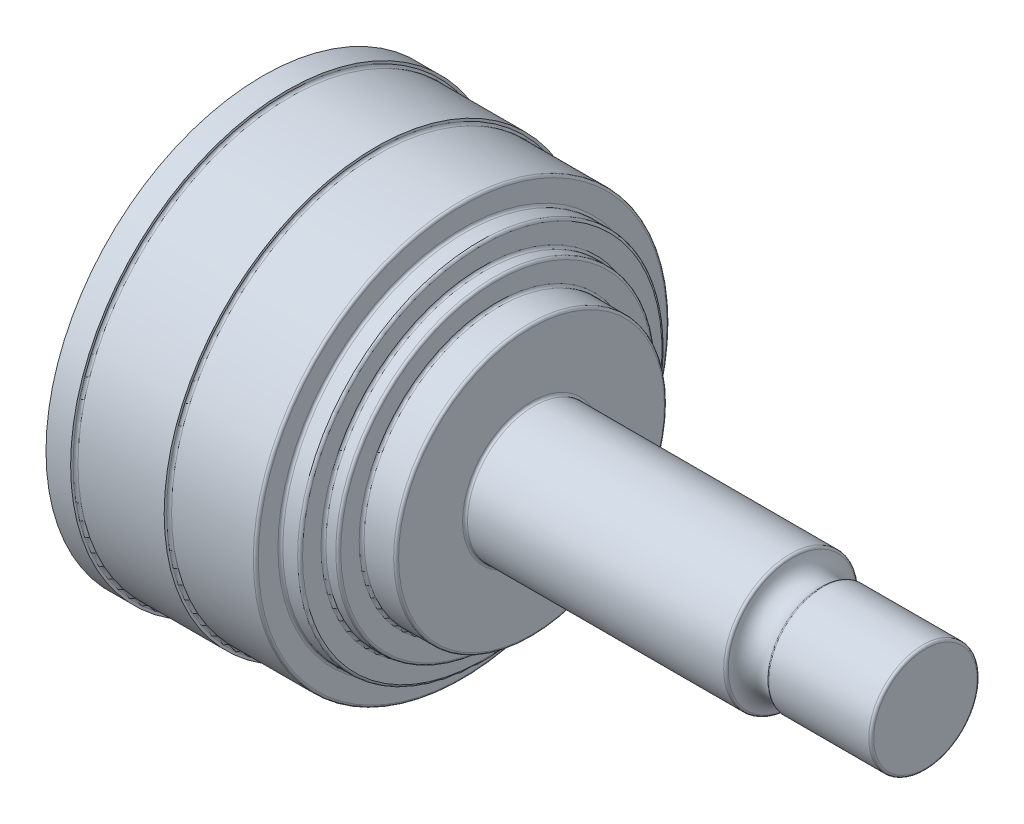
ISO-10303-21;
HEADER;
FILE_DESCRIPTION(('STEP AP214'),'2;1');
FILE_NAME('part.step','',(''),(''),'','','');
FILE_SCHEMA(('AUTOMOTIVE_DESIGN { 1 0 10303 214 1 1 1 1 }'));
ENDSEC;
DATA;
#1=APPLICATION_CONTEXT('core data for automotive mechanical design processes');
#2=APPLICATION_PROTOCOL_DEFINITION('international standard','automotive_design',2000,#1);
#3=PRODUCT_CONTEXT('',#1,'mechanical');
#4=PRODUCT('Part','Part','',(#3));
#5=PRODUCT_RELATED_PRODUCT_CATEGORY('part','',(#4));
#6=PRODUCT_DEFINITION_FORMATION('','',#4);
#7=PRODUCT_DEFINITION_CONTEXT('part definition',#1,'design');
#8=PRODUCT_DEFINITION('design','',#6,#7);
#9=PRODUCT_DEFINITION_SHAPE('','',#8);
#10=(LENGTH_UNIT() NAMED_UNIT(*) SI_UNIT(.MILLI.,.METRE.));
#11=(NAMED_UNIT(*) PLANE_ANGLE_UNIT() SI_UNIT($,.RADIAN.));
#12=(NAMED_UNIT(*) SI_UNIT($,.STERADIAN.) SOLID_ANGLE_UNIT());
#13=UNCERTAINTY_MEASURE_WITH_UNIT(LENGTH_MEASURE(1.E-05),#10,'distance_accuracy_value','');
#14=(GEOMETRIC_REPRESENTATION_CONTEXT(3) GLOBAL_UNCERTAINTY_ASSIGNED_CONTEXT((#13)) GLOBAL_UNIT_ASSIGNED_CONTEXT((#10,
#11,#12)) REPRESENTATION_CONTEXT('',''));
#15=CARTESIAN_POINT('',(0.,0.,0.));
#16=DIRECTION('',(0.,0.,1.));
#17=DIRECTION('',(1.,0.,0.));
#18=AXIS2_PLACEMENT_3D('',#15,#16,#17);
#19=CARTESIAN_POINT('',(134.6,0.,0.));
#20=DIRECTION('',(-1.,0.,0.));
#21=DIRECTION('',(0.,0.,1.));
#22=AXIS2_PLACEMENT_3D('',#19,#20,#21);
#23=PLANE('',#22);
#24=CARTESIAN_POINT('',(134.6,0.,0.));
#25=DIRECTION('',(-1.,0.,0.));
#26=DIRECTION('',(0.,0.,1.));
#27=AXIS2_PLACEMENT_3D('',#24,#25,#26);
#28=CIRCLE('',#27,10.5);
#29=CARTESIAN_POINT('',(134.6,0.,10.5));
#30=VERTEX_POINT('',#29);
#31=EDGE_CURVE('E112',#30,#30,#28,.F.);
#32=ORIENTED_EDGE('',*,*,#31,.T.);
#33=EDGE_LOOP('',(#32));
#34=FACE_BOUND('',#33,.T.);
#35=ADVANCED_FACE('F35',(#34),#23,.F.);
#36=CARTESIAN_POINT('',(-159.727345131747,0.,0.));
#37=DIRECTION('',(-1.,0.,0.));
#38=DIRECTION('',(0.,0.,1.));
#39=AXIS2_PLACEMENT_3D('',#36,#37,#38);
#40=CYLINDRICAL_SURFACE('',#39,11.);
#41=CARTESIAN_POINT('',(134.1,0.,0.));
#42=DIRECTION('',(-1.,0.,0.));
#43=DIRECTION('',(0.,0.,1.));
#44=AXIS2_PLACEMENT_3D('',#41,#42,#43);
#45=CIRCLE('',#44,11.);
#46=CARTESIAN_POINT('',(134.1,0.,11.));
#47=VERTEX_POINT('',#46);
#48=EDGE_CURVE('E115',#47,#47,#45,.T.);
#49=ORIENTED_EDGE('',*,*,#48,.T.);
#50=EDGE_LOOP('',(#49));
#51=FACE_BOUND('',#50,.T.);
#52=CARTESIAN_POINT('',(113.797977463642,0.,0.));
#53=DIRECTION('',(1.,0.,0.));
#54=DIRECTION('',(0.,0.,-1.));
#55=AXIS2_PLACEMENT_3D('',#52,#53,#54);
#56=CIRCLE('',#55,11.);
#57=CARTESIAN_POINT('',(113.797977463642,0.,-11.));
#58=VERTEX_POINT('',#57);
#59=EDGE_CURVE('E118',#58,#58,#56,.T.);
#60=ORIENTED_EDGE('',*,*,#59,.T.);
#61=EDGE_LOOP('',(#60));
#62=FACE_BOUND('',#61,.T.);
#63=ADVANCED_FACE('F149',(#51,#62),#40,.T.);
#64=CARTESIAN_POINT('',(111.120833333333,0.,0.));
#65=DIRECTION('',(-1.,0.,0.));
#66=DIRECTION('',(0.,0.,1.));
#67=AXIS2_PLACEMENT_3D('',#64,#65,#66);
#68=TOROIDAL_SURFACE('',#67,13.5,3.52083333333331);
#69=CARTESIAN_POINT('',(113.465068348992,0.,0.));
#70=DIRECTION('',(-1.,0.,0.));
#71=DIRECTION('',(0.,0.,1.));
#72=AXIS2_PLACEMENT_3D('',#69,#70,#71);
#73=CIRCLE('',#72,10.8730569948187);
#74=CARTESIAN_POINT('',(113.465068348992,0.,10.8730569948187));
#75=VERTEX_POINT('',#74);
#76=EDGE_CURVE('E106',#75,#75,#73,.T.);
#77=ORIENTED_EDGE('',*,*,#76,.T.);
#78=EDGE_LOOP('',(#77));
#79=FACE_BOUND('',#78,.T.);
#80=CARTESIAN_POINT('',(107.627328266597,0.,0.));
#81=DIRECTION('',(1.,0.,0.));
#82=DIRECTION('',(0.,0.,-1.));
#83=AXIS2_PLACEMENT_3D('',#80,#81,#82);
#84=CIRCLE('',#83,13.0621761658032);
#85=CARTESIAN_POINT('',(107.627328266597,0.,-13.0621761658032));
#86=VERTEX_POINT('',#85);
#87=EDGE_CURVE('E109',#86,#86,#84,.T.);
#88=ORIENTED_EDGE('',*,*,#87,.T.);
#89=EDGE_LOOP('',(#88));
#90=FACE_BOUND('',#89,.T.);
#91=ADVANCED_FACE('F155',(#79,#90),#68,.F.);
#92=CARTESIAN_POINT('',(-159.727345131747,0.,0.));
#93=DIRECTION('',(-1.,0.,0.));
#94=DIRECTION('',(0.,0.,1.));
#95=AXIS2_PLACEMENT_3D('',#92,#93,#94);
#96=CYLINDRICAL_SURFACE('',#95,13.5);
#97=CARTESIAN_POINT('',(107.131209203864,0.,0.));
#98=DIRECTION('',(1.,0.,0.));
#99=DIRECTION('',(0.,0.,-1.));
#100=AXIS2_PLACEMENT_3D('',#97,#98,#99);
#101=CIRCLE('',#100,13.5);
#102=CARTESIAN_POINT('',(107.131209203864,0.,-13.5));
#103=VERTEX_POINT('',#102);
#104=EDGE_CURVE('E100',#103,#103,#101,.F.);
#105=ORIENTED_EDGE('',*,*,#104,.T.);
#106=EDGE_LOOP('',(#105));
#107=FACE_BOUND('',#106,.T.);
#108=CARTESIAN_POINT('',(55.1,0.,0.));
#109=DIRECTION('',(-1.,0.,0.));
#110=DIRECTION('',(0.,0.,1.));
#111=AXIS2_PLACEMENT_3D('',#108,#109,#110);
#112=CIRCLE('',#111,13.5);
#113=CARTESIAN_POINT('',(55.1,0.,13.5));
#114=VERTEX_POINT('',#113);
#115=EDGE_CURVE('E103',#114,#114,#112,.F.);
#116=ORIENTED_EDGE('',*,*,#115,.T.);
#117=EDGE_LOOP('',(#116));
#118=FACE_BOUND('',#117,.T.);
#119=ADVANCED_FACE('F253',(#107,#118),#96,.T.);
#120=CARTESIAN_POINT('',(54.6,13.5,0.));
#121=DIRECTION('',(-1.,0.,0.));
#122=DIRECTION('',(0.,0.,1.));
#123=AXIS2_PLACEMENT_3D('',#120,#121,#122);
#124=PLANE('',#123);
#125=CARTESIAN_POINT('',(54.6,0.,0.));
#126=DIRECTION('',(-1.,0.,0.));
#127=DIRECTION('',(0.,0.,1.));
#128=AXIS2_PLACEMENT_3D('',#125,#126,#127);
#129=CIRCLE('',#128,14.);
#130=CARTESIAN_POINT('',(54.6,0.,14.));
#131=VERTEX_POINT('',#130);
#132=EDGE_CURVE('E94',#131,#131,#129,.T.);
#133=ORIENTED_EDGE('',*,*,#132,.T.);
#134=EDGE_LOOP('',(#133));
#135=FACE_BOUND('',#134,.T.);
#136=CARTESIAN_POINT('',(54.6,0.,0.));
#137=DIRECTION('',(-1.,0.,0.));
#138=DIRECTION('',(0.,0.,1.));
#139=AXIS2_PLACEMENT_3D('',#136,#137,#138);
#140=CIRCLE('',#139,27.);
#141=CARTESIAN_POINT('',(54.6,0.,27.));
#142=VERTEX_POINT('',#141);
#143=EDGE_CURVE('E97',#142,#142,#140,.F.);
#144=ORIENTED_EDGE('',*,*,#143,.T.);
#145=EDGE_LOOP('',(#144));
#146=FACE_BOUND('',#145,.T.);
#147=ADVANCED_FACE('F249',(#135,#146),#124,.F.);
#148=CARTESIAN_POINT('',(-159.727345131747,0.,0.));
#149=DIRECTION('',(-1.,0.,0.));
#150=DIRECTION('',(0.,0.,1.));
#151=AXIS2_PLACEMENT_3D('',#148,#149,#150);
#152=CYLINDRICAL_SURFACE('',#151,27.5);
#153=CARTESIAN_POINT('',(54.1,0.,0.));
#154=DIRECTION('',(-1.,0.,0.));
#155=DIRECTION('',(0.,0.,1.));
#156=AXIS2_PLACEMENT_3D('',#153,#154,#155);
#157=CIRCLE('',#156,27.5);
#158=CARTESIAN_POINT('',(54.1,0.,27.5));
#159=VERTEX_POINT('',#158);
#160=EDGE_CURVE('E88',#159,#159,#157,.T.);
#161=ORIENTED_EDGE('',*,*,#160,.T.);
#162=EDGE_LOOP('',(#161));
#163=FACE_BOUND('',#162,.T.);
#164=CARTESIAN_POINT('',(48.1,0.,0.));
#165=DIRECTION('',(-1.,0.,0.));
#166=DIRECTION('',(0.,0.,1.));
#167=AXIS2_PLACEMENT_3D('',#164,#165,#166);
#168=CIRCLE('',#167,27.5);
#169=CARTESIAN_POINT('',(48.1,0.,27.5));
#170=VERTEX_POINT('',#169);
#171=EDGE_CURVE('E91',#170,#170,#168,.F.);
#172=ORIENTED_EDGE('',*,*,#171,.T.);
#173=EDGE_LOOP('',(#172));
#174=FACE_BOUND('',#173,.T.);
#175=ADVANCED_FACE('F245',(#163,#174),#152,.T.);
#176=CARTESIAN_POINT('',(47.6,27.5,0.));
#177=DIRECTION('',(-1.,0.,0.));
#178=DIRECTION('',(0.,0.,1.));
#179=AXIS2_PLACEMENT_3D('',#176,#177,#178);
#180=PLANE('',#179);
#181=CARTESIAN_POINT('',(47.6,0.,0.));
#182=DIRECTION('',(-1.,0.,0.));
#183=DIRECTION('',(0.,0.,1.));
#184=AXIS2_PLACEMENT_3D('',#181,#182,#183);
#185=CIRCLE('',#184,28.);
#186=CARTESIAN_POINT('',(47.6,0.,28.));
#187=VERTEX_POINT('',#186);
#188=EDGE_CURVE('E82',#187,#187,#185,.T.);
#189=ORIENTED_EDGE('',*,*,#188,.T.);
#190=EDGE_LOOP('',(#189));
#191=FACE_BOUND('',#190,.T.);
#192=CARTESIAN_POINT('',(47.6,0.,0.));
#193=DIRECTION('',(-1.,0.,0.));
#194=DIRECTION('',(0.,0.,1.));
#195=AXIS2_PLACEMENT_3D('',#192,#193,#194);
#196=CIRCLE('',#195,31.75);
#197=CARTESIAN_POINT('',(47.6,0.,31.75));
#198=VERTEX_POINT('',#197);
#199=EDGE_CURVE('E85',#198,#198,#196,.F.);
#200=ORIENTED_EDGE('',*,*,#199,.T.);
#201=EDGE_LOOP('',(#200));
#202=FACE_BOUND('',#201,.T.);
#203=ADVANCED_FACE('F241',(#191,#202),#180,.F.);
#204=CARTESIAN_POINT('',(-159.727345131747,0.,0.));
#205=DIRECTION('',(-1.,0.,0.));
#206=DIRECTION('',(0.,0.,1.));
#207=AXIS2_PLACEMENT_3D('',#204,#205,#206);
#208=CYLINDRICAL_SURFACE('',#207,32.25);
#209=CARTESIAN_POINT('',(47.1,0.,0.));
#210=DIRECTION('',(-1.,0.,0.));
#211=DIRECTION('',(0.,0.,1.));
#212=AXIS2_PLACEMENT_3D('',#209,#210,#211);
#213=CIRCLE('',#212,32.25);
#214=CARTESIAN_POINT('',(47.1,0.,32.25));
#215=VERTEX_POINT('',#214);
#216=EDGE_CURVE('E76',#215,#215,#213,.T.);
#217=ORIENTED_EDGE('',*,*,#216,.T.);
#218=EDGE_LOOP('',(#217));
#219=FACE_BOUND('',#218,.T.);
#220=CARTESIAN_POINT('',(45.1,0.,0.));
#221=DIRECTION('',(-1.,0.,0.));
#222=DIRECTION('',(0.,0.,1.));
#223=AXIS2_PLACEMENT_3D('',#220,#221,#222);
#224=CIRCLE('',#223,32.25);
#225=CARTESIAN_POINT('',(45.1,0.,32.25));
#226=VERTEX_POINT('',#225);
#227=EDGE_CURVE('E79',#226,#226,#224,.F.);
#228=ORIENTED_EDGE('',*,*,#227,.T.);
#229=EDGE_LOOP('',(#228));
#230=FACE_BOUND('',#229,.T.);
#231=ADVANCED_FACE('F237',(#219,#230),#208,.T.);
#232=CARTESIAN_POINT('',(44.6,32.25,0.));
#233=DIRECTION('',(-1.,0.,0.));
#234=DIRECTION('',(0.,0.,1.));
#235=AXIS2_PLACEMENT_3D('',#232,#233,#234);
#236=PLANE('',#235);
#237=CARTESIAN_POINT('',(44.6,0.,0.));
#238=DIRECTION('',(-1.,0.,0.));
#239=DIRECTION('',(0.,0.,1.));
#240=AXIS2_PLACEMENT_3D('',#237,#238,#239);
#241=CIRCLE('',#240,32.75);
#242=CARTESIAN_POINT('',(44.6,0.,32.75));
#243=VERTEX_POINT('',#242);
#244=EDGE_CURVE('E70',#243,#243,#241,.T.);
#245=ORIENTED_EDGE('',*,*,#244,.T.);
#246=EDGE_LOOP('',(#245));
#247=FACE_BOUND('',#246,.T.);
#248=CARTESIAN_POINT('',(44.6,0.,0.));
#249=DIRECTION('',(-1.,0.,0.));
#250=DIRECTION('',(0.,0.,1.));
#251=AXIS2_PLACEMENT_3D('',#248,#249,#250);
#252=CIRCLE('',#251,36.5);
#253=CARTESIAN_POINT('',(44.6,0.,36.5));
#254=VERTEX_POINT('',#253);
#255=EDGE_CURVE('E73',#254,#254,#252,.F.);
#256=ORIENTED_EDGE('',*,*,#255,.T.);
#257=EDGE_LOOP('',(#256));
#258=FACE_BOUND('',#257,.T.);
#259=ADVANCED_FACE('F233',(#247,#258),#236,.F.);
#260=CARTESIAN_POINT('',(-159.727345131747,0.,0.));
#261=DIRECTION('',(-1.,0.,0.));
#262=DIRECTION('',(0.,0.,1.));
#263=AXIS2_PLACEMENT_3D('',#260,#261,#262);
#264=CYLINDRICAL_SURFACE('',#263,37.);
#265=CARTESIAN_POINT('',(44.1,0.,0.));
#266=DIRECTION('',(-1.,0.,0.));
#267=DIRECTION('',(0.,0.,1.));
#268=AXIS2_PLACEMENT_3D('',#265,#266,#267);
#269=CIRCLE('',#268,37.);
#270=CARTESIAN_POINT('',(44.1,0.,37.));
#271=VERTEX_POINT('',#270);
#272=EDGE_CURVE('E64',#271,#271,#269,.T.);
#273=ORIENTED_EDGE('',*,*,#272,.T.);
#274=EDGE_LOOP('',(#273));
#275=FACE_BOUND('',#274,.T.);
#276=CARTESIAN_POINT('',(41.1,0.,0.));
#277=DIRECTION('',(-1.,0.,0.));
#278=DIRECTION('',(0.,0.,1.));
#279=AXIS2_PLACEMENT_3D('',#276,#277,#278);
#280=CIRCLE('',#279,37.);
#281=CARTESIAN_POINT('',(41.1,0.,37.));
#282=VERTEX_POINT('',#281);
#283=EDGE_CURVE('E67',#282,#282,#280,.F.);
#284=ORIENTED_EDGE('',*,*,#283,.T.);
#285=EDGE_LOOP('',(#284));
#286=FACE_BOUND('',#285,.T.);
#287=ADVANCED_FACE('F229',(#275,#286),#264,.T.);
#288=CARTESIAN_POINT('',(40.6,37.,0.));
#289=DIRECTION('',(-1.,0.,0.));
#290=DIRECTION('',(0.,0.,1.));
#291=AXIS2_PLACEMENT_3D('',#288,#289,#290);
#292=PLANE('',#291);
#293=CARTESIAN_POINT('',(40.6,0.,0.));
#294=DIRECTION('',(-1.,0.,0.));
#295=DIRECTION('',(0.,0.,1.));
#296=AXIS2_PLACEMENT_3D('',#293,#294,#295);
#297=CIRCLE('',#296,37.5);
#298=CARTESIAN_POINT('',(40.6,0.,37.5));
#299=VERTEX_POINT('',#298);
#300=EDGE_CURVE('E58',#299,#299,#297,.T.);
#301=ORIENTED_EDGE('',*,*,#300,.T.);
#302=EDGE_LOOP('',(#301));
#303=FACE_BOUND('',#302,.T.);
#304=CARTESIAN_POINT('',(40.6,0.,0.));
#305=DIRECTION('',(-1.,0.,0.));
#306=DIRECTION('',(0.,0.,1.));
#307=AXIS2_PLACEMENT_3D('',#304,#305,#306);
#308=CIRCLE('',#307,41.5);
#309=CARTESIAN_POINT('',(40.6,0.,41.5));
#310=VERTEX_POINT('',#309);
#311=EDGE_CURVE('E61',#310,#310,#308,.F.);
#312=ORIENTED_EDGE('',*,*,#311,.T.);
#313=EDGE_LOOP('',(#312));
#314=FACE_BOUND('',#313,.T.);
#315=ADVANCED_FACE('F223',(#303,#314),#292,.F.);
#316=CARTESIAN_POINT('',(-159.727345131747,0.,0.));
#317=DIRECTION('',(-1.,0.,0.));
#318=DIRECTION('',(0.,0.,1.));
#319=AXIS2_PLACEMENT_3D('',#316,#317,#318);
#320=CYLINDRICAL_SURFACE('',#319,42.);
#321=CARTESIAN_POINT('',(40.1,0.,0.));
#322=DIRECTION('',(-1.,0.,0.));
#323=DIRECTION('',(0.,0.,1.));
#324=AXIS2_PLACEMENT_3D('',#321,#322,#323);
#325=CIRCLE('',#324,42.);
#326=CARTESIAN_POINT('',(40.1,0.,42.));
#327=VERTEX_POINT('',#326);
#328=EDGE_CURVE('E50',#327,#327,#325,.T.);
#329=ORIENTED_EDGE('',*,*,#328,.T.);
#330=EDGE_LOOP('',(#329));
#331=FACE_BOUND('',#330,.T.);
#332=CARTESIAN_POINT('',(23.5,0.,0.));
#333=DIRECTION('',(-1.,0.,0.));
#334=DIRECTION('',(0.,0.,1.));
#335=AXIS2_PLACEMENT_3D('',#332,#333,#334);
#336=CIRCLE('',#335,42.);
#337=CARTESIAN_POINT('',(23.5,0.,42.));
#338=VERTEX_POINT('',#337);
#339=EDGE_CURVE('E55',#338,#338,#336,.F.);
#340=ORIENTED_EDGE('',*,*,#339,.T.);
#341=EDGE_LOOP('',(#340));
#342=FACE_BOUND('',#341,.T.);
#343=ADVANCED_FACE('F216',(#331,#342),#320,.T.);
#344=CARTESIAN_POINT('',(23.,42.,0.));
#345=DIRECTION('',(-1.,0.,0.));
#346=DIRECTION('',(0.,0.,1.));
#347=AXIS2_PLACEMENT_3D('',#344,#345,#346);
#348=PLANE('',#347);
#349=CARTESIAN_POINT('',(23.,0.,0.));
#350=DIRECTION('',(-1.,0.,0.));
#351=DIRECTION('',(0.,0.,1.));
#352=AXIS2_PLACEMENT_3D('',#349,#350,#351);
#353=CIRCLE('',#352,42.5);
#354=CARTESIAN_POINT('',(23.,0.,42.5));
#355=VERTEX_POINT('',#354);
#356=EDGE_CURVE('E46',#355,#355,#353,.T.);
#357=ORIENTED_EDGE('',*,*,#356,.T.);
#358=EDGE_LOOP('',(#357));
#359=FACE_BOUND('',#358,.T.);
#360=CARTESIAN_POINT('',(23.,0.,0.));
#361=DIRECTION('',(-1.,0.,0.));
#362=DIRECTION('',(0.,0.,1.));
#363=AXIS2_PLACEMENT_3D('',#360,#361,#362);
#364=CIRCLE('',#363,43.);
#365=CARTESIAN_POINT('',(23.,0.,43.));
#366=VERTEX_POINT('',#365);
#367=EDGE_CURVE('E121',#366,#366,#364,.T.);
#368=ORIENTED_EDGE('',*,*,#367,.F.);
#369=EDGE_LOOP('',(#368));
#370=FACE_BOUND('',#369,.T.);
#371=ADVANCED_FACE('F146',(#359,#370),#348,.F.);
#372=CARTESIAN_POINT('',(-159.727345131747,0.,0.));
#373=DIRECTION('',(-1.,0.,0.));
#374=DIRECTION('',(0.,0.,1.));
#375=AXIS2_PLACEMENT_3D('',#372,#373,#374);
#376=CYLINDRICAL_SURFACE('',#375,43.);
#377=CARTESIAN_POINT('',(5.50000000000001,0.,0.));
#378=DIRECTION('',(-1.,0.,0.));
#379=DIRECTION('',(0.,0.,1.));
#380=AXIS2_PLACEMENT_3D('',#377,#378,#379);
#381=CIRCLE('',#380,43.);
#382=CARTESIAN_POINT('',(5.50000000000001,0.,43.));
#383=VERTEX_POINT('',#382);
#384=EDGE_CURVE('E10',#383,#383,#381,.F.);
#385=ORIENTED_EDGE('',*,*,#384,.T.);
#386=EDGE_LOOP('',(#385));
#387=FACE_BOUND('',#386,.T.);
#388=ORIENTED_EDGE('',*,*,#367,.T.);
#389=EDGE_LOOP('',(#388));
#390=FACE_BOUND('',#389,.T.);
#391=ADVANCED_FACE('F141',(#387,#390),#376,.T.);
#392=CARTESIAN_POINT('',(5.,43.,0.));
#393=DIRECTION('',(-1.,0.,0.));
#394=DIRECTION('',(0.,0.,1.));
#395=AXIS2_PLACEMENT_3D('',#392,#393,#394);
#396=PLANE('',#395);
#397=CARTESIAN_POINT('',(5.,0.,0.));
#398=DIRECTION('',(-1.,0.,0.));
#399=DIRECTION('',(0.,0.,1.));
#400=AXIS2_PLACEMENT_3D('',#397,#398,#399);
#401=CIRCLE('',#400,43.5);
#402=CARTESIAN_POINT('',(5.,0.,43.5));
#403=VERTEX_POINT('',#402);
#404=EDGE_CURVE('E42',#403,#403,#401,.T.);
#405=ORIENTED_EDGE('',*,*,#404,.T.);
#406=EDGE_LOOP('',(#405));
#407=FACE_BOUND('',#406,.T.);
#408=CARTESIAN_POINT('',(5.,0.,0.));
#409=DIRECTION('',(-1.,0.,0.));
#410=DIRECTION('',(0.,0.,1.));
#411=AXIS2_PLACEMENT_3D('',#408,#409,#410);
#412=CIRCLE('',#411,44.);
#413=CARTESIAN_POINT('',(5.,0.,44.));
#414=VERTEX_POINT('',#413);
#415=EDGE_CURVE('E124',#414,#414,#412,.T.);
#416=ORIENTED_EDGE('',*,*,#415,.F.);
#417=EDGE_LOOP('',(#416));
#418=FACE_BOUND('',#417,.T.);
#419=ADVANCED_FACE('F136',(#407,#418),#396,.F.);
#420=CARTESIAN_POINT('',(-159.727345131747,0.,0.));
#421=DIRECTION('',(-1.,0.,0.));
#422=DIRECTION('',(0.,0.,1.));
#423=AXIS2_PLACEMENT_3D('',#420,#421,#422);
#424=CYLINDRICAL_SURFACE('',#423,44.);
#425=CARTESIAN_POINT('',(0.,0.,0.));
#426=DIRECTION('',(-1.,0.,0.));
#427=DIRECTION('',(0.,0.,1.));
#428=AXIS2_PLACEMENT_3D('',#425,#426,#427);
#429=CIRCLE('',#428,44.0000000000001);
#430=CARTESIAN_POINT('',(0.,0.,44.0000000000001));
#431=VERTEX_POINT('',#430);
#432=EDGE_CURVE('E127',#431,#431,#429,.T.);
#433=ORIENTED_EDGE('',*,*,#432,.F.);
#434=EDGE_LOOP('',(#433));
#435=FACE_BOUND('',#434,.T.);
#436=ORIENTED_EDGE('',*,*,#415,.T.);
#437=EDGE_LOOP('',(#436));
#438=FACE_BOUND('',#437,.T.);
#439=ADVANCED_FACE('F133',(#435,#438),#424,.T.);
#440=CARTESIAN_POINT('',(0.,44.0000000000001,0.));
#441=DIRECTION('',(1.,0.,0.));
#442=DIRECTION('',(0.,0.,-1.));
#443=AXIS2_PLACEMENT_3D('',#440,#441,#442);
#444=PLANE('',#443);
#445=ORIENTED_EDGE('',*,*,#432,.T.);
#446=EDGE_LOOP('',(#445));
#447=FACE_BOUND('',#446,.T.);
#448=ADVANCED_FACE('F131',(#447),#444,.F.);
#449=CARTESIAN_POINT('',(134.1,0.,0.));
#450=DIRECTION('',(-1.,0.,0.));
#451=DIRECTION('',(0.,0.,1.));
#452=AXIS2_PLACEMENT_3D('',#449,#450,#451);
#453=TOROIDAL_SURFACE('',#452,10.5,0.5);
#454=ORIENTED_EDGE('',*,*,#31,.F.);
#455=EDGE_LOOP('',(#454));
#456=FACE_BOUND('',#455,.T.);
#457=ORIENTED_EDGE('',*,*,#48,.F.);
#458=EDGE_LOOP('',(#457));
#459=FACE_BOUND('',#458,.T.);
#460=ADVANCED_FACE('F160',(#456,#459),#453,.T.);
#461=CARTESIAN_POINT('',(113.797977463642,0.,0.));
#462=DIRECTION('',(1.,0.,0.));
#463=DIRECTION('',(0.,0.,-1.));
#464=AXIS2_PLACEMENT_3D('',#461,#462,#463);
#465=TOROIDAL_SURFACE('',#464,10.5,0.5);
#466=ORIENTED_EDGE('',*,*,#59,.F.);
#467=EDGE_LOOP('',(#466));
#468=FACE_BOUND('',#467,.T.);
#469=ORIENTED_EDGE('',*,*,#76,.F.);
#470=EDGE_LOOP('',(#469));
#471=FACE_BOUND('',#470,.T.);
#472=ADVANCED_FACE('F163',(#468,#471),#465,.T.);
#473=CARTESIAN_POINT('',(107.131209203864,0.,0.));
#474=DIRECTION('',(1.,0.,0.));
#475=DIRECTION('',(0.,0.,-1.));
#476=AXIS2_PLACEMENT_3D('',#473,#474,#475);
#477=TOROIDAL_SURFACE('',#476,13.,0.5);
#478=ORIENTED_EDGE('',*,*,#87,.F.);
#479=EDGE_LOOP('',(#478));
#480=FACE_BOUND('',#479,.T.);
#481=ORIENTED_EDGE('',*,*,#104,.F.);
#482=EDGE_LOOP('',(#481));
#483=FACE_BOUND('',#482,.T.);
#484=ADVANCED_FACE('F167',(#480,#483),#477,.T.);
#485=CARTESIAN_POINT('',(55.1,0.,0.));
#486=DIRECTION('',(-1.,0.,0.));
#487=DIRECTION('',(0.,0.,1.));
#488=AXIS2_PLACEMENT_3D('',#485,#486,#487);
#489=TOROIDAL_SURFACE('',#488,14.,0.5);
#490=ORIENTED_EDGE('',*,*,#115,.F.);
#491=EDGE_LOOP('',(#490));
#492=FACE_BOUND('',#491,.T.);
#493=ORIENTED_EDGE('',*,*,#132,.F.);
#494=EDGE_LOOP('',(#493));
#495=FACE_BOUND('',#494,.T.);
#496=ADVANCED_FACE('F171',(#492,#495),#489,.F.);
#497=CARTESIAN_POINT('',(54.1,0.,0.));
#498=DIRECTION('',(-1.,0.,0.));
#499=DIRECTION('',(0.,0.,1.));
#500=AXIS2_PLACEMENT_3D('',#497,#498,#499);
#501=TOROIDAL_SURFACE('',#500,27.,0.5);
#502=ORIENTED_EDGE('',*,*,#143,.F.);
#503=EDGE_LOOP('',(#502));
#504=FACE_BOUND('',#503,.T.);
#505=ORIENTED_EDGE('',*,*,#160,.F.);
#506=EDGE_LOOP('',(#505));
#507=FACE_BOUND('',#506,.T.);
#508=ADVANCED_FACE('F175',(#504,#507),#501,.T.);
#509=CARTESIAN_POINT('',(48.1,0.,0.));
#510=DIRECTION('',(-1.,0.,0.));
#511=DIRECTION('',(0.,0.,1.));
#512=AXIS2_PLACEMENT_3D('',#509,#510,#511);
#513=TOROIDAL_SURFACE('',#512,28.,0.5);
#514=ORIENTED_EDGE('',*,*,#171,.F.);
#515=EDGE_LOOP('',(#514));
#516=FACE_BOUND('',#515,.T.);
#517=ORIENTED_EDGE('',*,*,#188,.F.);
#518=EDGE_LOOP('',(#517));
#519=FACE_BOUND('',#518,.T.);
#520=ADVANCED_FACE('F179',(#516,#519),#513,.F.);
#521=CARTESIAN_POINT('',(47.1,0.,0.));
#522=DIRECTION('',(-1.,0.,0.));
#523=DIRECTION('',(0.,0.,1.));
#524=AXIS2_PLACEMENT_3D('',#521,#522,#523);
#525=TOROIDAL_SURFACE('',#524,31.75,0.5);
#526=ORIENTED_EDGE('',*,*,#199,.F.);
#527=EDGE_LOOP('',(#526));
#528=FACE_BOUND('',#527,.T.);
#529=ORIENTED_EDGE('',*,*,#216,.F.);
#530=EDGE_LOOP('',(#529));
#531=FACE_BOUND('',#530,.T.);
#532=ADVANCED_FACE('F183',(#528,#531),#525,.T.);
#533=CARTESIAN_POINT('',(45.1,0.,0.));
#534=DIRECTION('',(-1.,0.,0.));
#535=DIRECTION('',(0.,0.,1.));
#536=AXIS2_PLACEMENT_3D('',#533,#534,#535);
#537=TOROIDAL_SURFACE('',#536,32.75,0.5);
#538=ORIENTED_EDGE('',*,*,#227,.F.);
#539=EDGE_LOOP('',(#538));
#540=FACE_BOUND('',#539,.T.);
#541=ORIENTED_EDGE('',*,*,#244,.F.);
#542=EDGE_LOOP('',(#541));
#543=FACE_BOUND('',#542,.T.);
#544=ADVANCED_FACE('F187',(#540,#543),#537,.F.);
#545=CARTESIAN_POINT('',(44.1,0.,0.));
#546=DIRECTION('',(-1.,0.,0.));
#547=DIRECTION('',(0.,0.,1.));
#548=AXIS2_PLACEMENT_3D('',#545,#546,#547);
#549=TOROIDAL_SURFACE('',#548,36.5,0.5);
#550=ORIENTED_EDGE('',*,*,#255,.F.);
#551=EDGE_LOOP('',(#550));
#552=FACE_BOUND('',#551,.T.);
#553=ORIENTED_EDGE('',*,*,#272,.F.);
#554=EDGE_LOOP('',(#553));
#555=FACE_BOUND('',#554,.T.);
#556=ADVANCED_FACE('F191',(#552,#555),#549,.T.);
#557=CARTESIAN_POINT('',(41.1,0.,0.));
#558=DIRECTION('',(-1.,0.,0.));
#559=DIRECTION('',(0.,0.,1.));
#560=AXIS2_PLACEMENT_3D('',#557,#558,#559);
#561=TOROIDAL_SURFACE('',#560,37.5,0.5);
#562=ORIENTED_EDGE('',*,*,#283,.F.);
#563=EDGE_LOOP('',(#562));
#564=FACE_BOUND('',#563,.T.);
#565=ORIENTED_EDGE('',*,*,#300,.F.);
#566=EDGE_LOOP('',(#565));
#567=FACE_BOUND('',#566,.T.);
#568=ADVANCED_FACE('F195',(#564,#567),#561,.F.);
#569=CARTESIAN_POINT('',(40.1,0.,0.));
#570=DIRECTION('',(-1.,0.,0.));
#571=DIRECTION('',(0.,0.,1.));
#572=AXIS2_PLACEMENT_3D('',#569,#570,#571);
#573=TOROIDAL_SURFACE('',#572,41.5,0.5);
#574=ORIENTED_EDGE('',*,*,#311,.F.);
#575=EDGE_LOOP('',(#574));
#576=FACE_BOUND('',#575,.T.);
#577=ORIENTED_EDGE('',*,*,#328,.F.);
#578=EDGE_LOOP('',(#577));
#579=FACE_BOUND('',#578,.T.);
#580=ADVANCED_FACE('F199',(#576,#579),#573,.T.);
#581=CARTESIAN_POINT('',(23.5,0.,0.));
#582=DIRECTION('',(-1.,0.,0.));
#583=DIRECTION('',(0.,0.,1.));
#584=AXIS2_PLACEMENT_3D('',#581,#582,#583);
#585=TOROIDAL_SURFACE('',#584,42.5,0.5);
#586=ORIENTED_EDGE('',*,*,#339,.F.);
#587=EDGE_LOOP('',(#586));
#588=FACE_BOUND('',#587,.T.);
#589=ORIENTED_EDGE('',*,*,#356,.F.);
#590=EDGE_LOOP('',(#589));
#591=FACE_BOUND('',#590,.T.);
#592=ADVANCED_FACE('F202',(#588,#591),#585,.F.);
#593=CARTESIAN_POINT('',(5.50000000000001,0.,0.));
#594=DIRECTION('',(-1.,0.,0.));
#595=DIRECTION('',(0.,0.,1.));
#596=AXIS2_PLACEMENT_3D('',#593,#594,#595);
#597=TOROIDAL_SURFACE('',#596,43.5,0.5);
#598=ORIENTED_EDGE('',*,*,#384,.F.);
#599=EDGE_LOOP('',(#598));
#600=FACE_BOUND('',#599,.T.);
#601=ORIENTED_EDGE('',*,*,#404,.F.);
#602=EDGE_LOOP('',(#601));
#603=FACE_BOUND('',#602,.T.);
#604=ADVANCED_FACE('F37',(#600,#603),#597,.F.);
#605=CLOSED_SHELL('',(#35,#63,#91,#119,#147,#175,#203,#231,#259,#287,#315,#343,#371,#391,#419,
#439,#448,#460,#472,#484,#496,#508,#520,#532,#544,#556,#568,#580,#592,#604));
#606=MANIFOLD_SOLID_BREP('B2',#605);
#607=ADVANCED_BREP_SHAPE_REPRESENTATION('',(#18,#606),#14);
#608=SHAPE_DEFINITION_REPRESENTATION(#9,#607);
ENDSEC;
END-ISO-10303-21;
